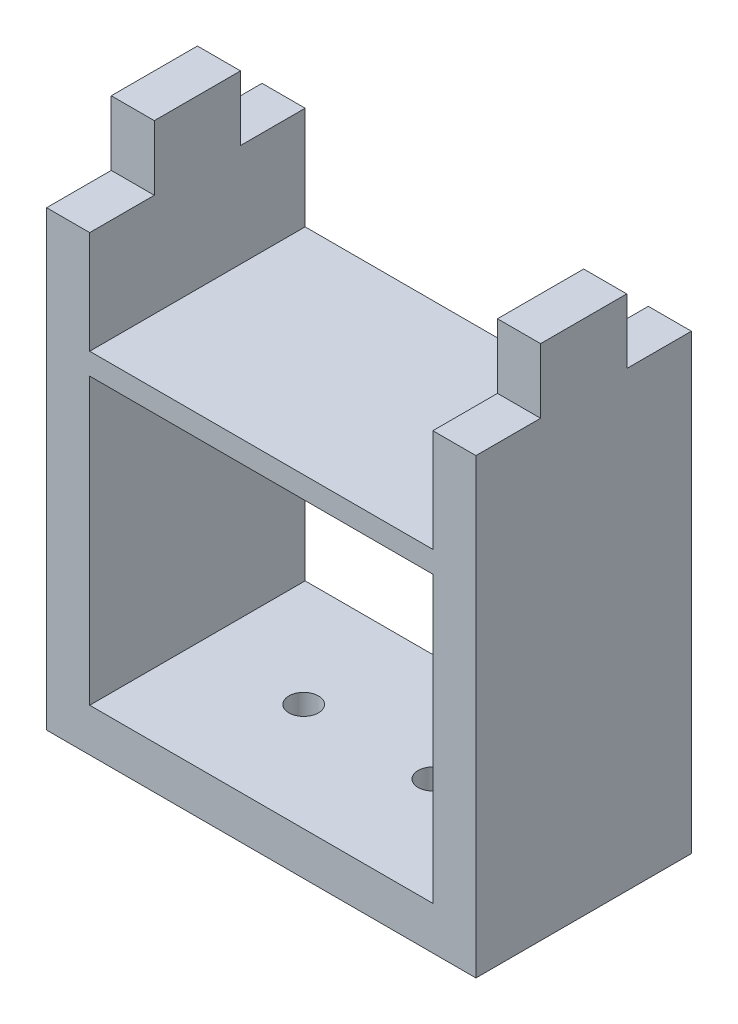
ISO-10303-21;
HEADER;
FILE_DESCRIPTION(('STEP AP214'),'2;1');
FILE_NAME('part.step','',(''),(''),'','','');
FILE_SCHEMA(('AUTOMOTIVE_DESIGN { 1 0 10303 214 1 1 1 1 }'));
ENDSEC;
DATA;
#1=APPLICATION_CONTEXT('core data for automotive mechanical design processes');
#2=APPLICATION_PROTOCOL_DEFINITION('international standard','automotive_design',2000,#1);
#3=PRODUCT_CONTEXT('',#1,'mechanical');
#4=PRODUCT('Part','Part','',(#3));
#5=PRODUCT_RELATED_PRODUCT_CATEGORY('part','',(#4));
#6=PRODUCT_DEFINITION_FORMATION('','',#4);
#7=PRODUCT_DEFINITION_CONTEXT('part definition',#1,'design');
#8=PRODUCT_DEFINITION('design','',#6,#7);
#9=PRODUCT_DEFINITION_SHAPE('','',#8);
#10=(LENGTH_UNIT() NAMED_UNIT(*) SI_UNIT(.MILLI.,.METRE.));
#11=(NAMED_UNIT(*) PLANE_ANGLE_UNIT() SI_UNIT($,.RADIAN.));
#12=(NAMED_UNIT(*) SI_UNIT($,.STERADIAN.) SOLID_ANGLE_UNIT());
#13=UNCERTAINTY_MEASURE_WITH_UNIT(LENGTH_MEASURE(1.E-05),#10,'distance_accuracy_value','');
#14=(GEOMETRIC_REPRESENTATION_CONTEXT(3) GLOBAL_UNCERTAINTY_ASSIGNED_CONTEXT((#13)) GLOBAL_UNIT_ASSIGNED_CONTEXT((#10,
#11,#12)) REPRESENTATION_CONTEXT('',''));
#15=CARTESIAN_POINT('',(0.,0.,0.));
#16=DIRECTION('',(0.,0.,1.));
#17=DIRECTION('',(1.,0.,0.));
#18=AXIS2_PLACEMENT_3D('',#15,#16,#17);
#19=CARTESIAN_POINT('',(71.8800104345077,105.,35.));
#20=DIRECTION('',(0.,-1.,0.));
#21=DIRECTION('',(1.,0.,0.));
#22=AXIS2_PLACEMENT_3D('',#19,#20,#21);
#23=PLANE('',#22);
#24=DIRECTION('',(0.,0.,-1.));
#25=VECTOR('',#24,1.);
#26=CARTESIAN_POINT('',(-30.5064857593433,105.,50.));
#27=LINE('',#26,#25);
#28=CARTESIAN_POINT('',(-30.5064857593433,105.,50.));
#29=VERTEX_POINT('',#28);
#30=CARTESIAN_POINT('',(-30.5064857593433,105.,35.));
#31=VERTEX_POINT('',#30);
#32=EDGE_CURVE('E351',#29,#31,#27,.T.);
#33=ORIENTED_EDGE('',*,*,#32,.T.);
#34=DIRECTION('',(-1.,0.,0.));
#35=VECTOR('',#34,1.);
#36=CARTESIAN_POINT('',(71.8800104345077,105.,35.));
#37=LINE('',#36,#35);
#38=CARTESIAN_POINT('',(-40.5064857593433,105.,35.));
#39=VERTEX_POINT('',#38);
#40=EDGE_CURVE('E11',#31,#39,#37,.T.);
#41=ORIENTED_EDGE('',*,*,#40,.T.);
#42=DIRECTION('',(0.,0.,-1.));
#43=VECTOR('',#42,1.);
#44=CARTESIAN_POINT('',(-40.5064857593433,105.,50.));
#45=LINE('',#44,#43);
#46=CARTESIAN_POINT('',(-40.5064857593433,105.,50.));
#47=VERTEX_POINT('',#46);
#48=EDGE_CURVE('E314',#47,#39,#45,.T.);
#49=ORIENTED_EDGE('',*,*,#48,.F.);
#50=DIRECTION('',(1.,0.,0.));
#51=VECTOR('',#50,1.);
#52=CARTESIAN_POINT('',(0.,105.,50.));
#53=LINE('',#52,#51);
#54=EDGE_CURVE('E335',#47,#29,#53,.T.);
#55=ORIENTED_EDGE('',*,*,#54,.T.);
#56=EDGE_LOOP('',(#33,#41,#49,#55));
#57=FACE_BOUND('',#56,.T.);
#58=ADVANCED_FACE('F43',(#57),#23,.F.);
#59=CARTESIAN_POINT('',(71.8800104345077,120.,35.));
#60=DIRECTION('',(0.,0.,-1.));
#61=DIRECTION('',(-1.,0.,0.));
#62=AXIS2_PLACEMENT_3D('',#59,#60,#61);
#63=PLANE('',#62);
#64=DIRECTION('',(0.,1.,0.));
#65=VECTOR('',#64,1.);
#66=CARTESIAN_POINT('',(-30.5064857593433,204.794329494483,35.));
#67=LINE('',#66,#65);
#68=CARTESIAN_POINT('',(-30.5064857593433,120.,35.));
#69=VERTEX_POINT('',#68);
#70=EDGE_CURVE('E354',#31,#69,#67,.T.);
#71=ORIENTED_EDGE('',*,*,#70,.T.);
#72=DIRECTION('',(-1.,0.,0.));
#73=VECTOR('',#72,1.);
#74=CARTESIAN_POINT('',(71.8800104345077,120.,35.));
#75=LINE('',#74,#73);
#76=CARTESIAN_POINT('',(-40.5064857593433,120.,35.));
#77=VERTEX_POINT('',#76);
#78=EDGE_CURVE('E337',#69,#77,#75,.T.);
#79=ORIENTED_EDGE('',*,*,#78,.T.);
#80=DIRECTION('',(0.,1.,0.));
#81=VECTOR('',#80,1.);
#82=CARTESIAN_POINT('',(-40.5064857593433,210.,35.));
#83=LINE('',#82,#81);
#84=EDGE_CURVE('E317',#39,#77,#83,.T.);
#85=ORIENTED_EDGE('',*,*,#84,.F.);
#86=ORIENTED_EDGE('',*,*,#40,.F.);
#87=EDGE_LOOP('',(#71,#79,#85,#86));
#88=FACE_BOUND('',#87,.T.);
#89=ADVANCED_FACE('F426',(#88),#63,.F.);
#90=CARTESIAN_POINT('',(71.8800104345077,120.,15.));
#91=DIRECTION('',(0.,-1.,0.));
#92=DIRECTION('',(1.,0.,0.));
#93=AXIS2_PLACEMENT_3D('',#90,#91,#92);
#94=PLANE('',#93);
#95=DIRECTION('',(0.,0.,-1.));
#96=VECTOR('',#95,1.);
#97=CARTESIAN_POINT('',(-30.5064857593433,120.,50.));
#98=LINE('',#97,#96);
#99=CARTESIAN_POINT('',(-30.5064857593433,120.,15.));
#100=VERTEX_POINT('',#99);
#101=EDGE_CURVE('E362',#69,#100,#98,.T.);
#102=ORIENTED_EDGE('',*,*,#101,.T.);
#103=DIRECTION('',(-1.,0.,0.));
#104=VECTOR('',#103,1.);
#105=CARTESIAN_POINT('',(71.8800104345077,120.,15.));
#106=LINE('',#105,#104);
#107=CARTESIAN_POINT('',(-40.5064857593433,120.,15.));
#108=VERTEX_POINT('',#107);
#109=EDGE_CURVE('E342',#100,#108,#106,.T.);
#110=ORIENTED_EDGE('',*,*,#109,.T.);
#111=DIRECTION('',(0.,0.,-1.));
#112=VECTOR('',#111,1.);
#113=CARTESIAN_POINT('',(-40.5064857593433,120.,50.));
#114=LINE('',#113,#112);
#115=EDGE_CURVE('E320',#77,#108,#114,.T.);
#116=ORIENTED_EDGE('',*,*,#115,.F.);
#117=ORIENTED_EDGE('',*,*,#78,.F.);
#118=EDGE_LOOP('',(#102,#110,#116,#117));
#119=FACE_BOUND('',#118,.T.);
#120=ADVANCED_FACE('F430',(#119),#94,.F.);
#121=CARTESIAN_POINT('',(71.8800104345077,105.,15.));
#122=DIRECTION('',(0.,0.,1.));
#123=DIRECTION('',(1.,0.,0.));
#124=AXIS2_PLACEMENT_3D('',#121,#122,#123);
#125=PLANE('',#124);
#126=DIRECTION('',(0.,-1.,0.));
#127=VECTOR('',#126,1.);
#128=CARTESIAN_POINT('',(-30.5064857593433,204.794329494483,15.));
#129=LINE('',#128,#127);
#130=CARTESIAN_POINT('',(-30.5064857593433,105.,15.));
#131=VERTEX_POINT('',#130);
#132=EDGE_CURVE('E368',#100,#131,#129,.T.);
#133=ORIENTED_EDGE('',*,*,#132,.T.);
#134=DIRECTION('',(-1.,0.,0.));
#135=VECTOR('',#134,1.);
#136=CARTESIAN_POINT('',(71.8800104345077,105.,15.));
#137=LINE('',#136,#135);
#138=CARTESIAN_POINT('',(-40.5064857593433,105.,15.));
#139=VERTEX_POINT('',#138);
#140=EDGE_CURVE('E347',#131,#139,#137,.T.);
#141=ORIENTED_EDGE('',*,*,#140,.T.);
#142=DIRECTION('',(0.,-1.,0.));
#143=VECTOR('',#142,1.);
#144=CARTESIAN_POINT('',(-40.5064857593433,210.,15.));
#145=LINE('',#144,#143);
#146=EDGE_CURVE('E323',#108,#139,#145,.T.);
#147=ORIENTED_EDGE('',*,*,#146,.F.);
#148=ORIENTED_EDGE('',*,*,#109,.F.);
#149=EDGE_LOOP('',(#133,#141,#147,#148));
#150=FACE_BOUND('',#149,.T.);
#151=ADVANCED_FACE('F639',(#150),#125,.F.);
#152=CARTESIAN_POINT('',(71.8800104345077,105.,0.));
#153=DIRECTION('',(0.,-1.,0.));
#154=DIRECTION('',(1.,0.,0.));
#155=AXIS2_PLACEMENT_3D('',#152,#153,#154);
#156=PLANE('',#155);
#157=DIRECTION('',(0.,0.,-1.));
#158=VECTOR('',#157,1.);
#159=CARTESIAN_POINT('',(-30.5064857593433,105.,50.));
#160=LINE('',#159,#158);
#161=CARTESIAN_POINT('',(-30.5064857593433,105.,0.));
#162=VERTEX_POINT('',#161);
#163=EDGE_CURVE('E358',#131,#162,#160,.T.);
#164=ORIENTED_EDGE('',*,*,#163,.T.);
#165=DIRECTION('',(1.,0.,0.));
#166=VECTOR('',#165,1.);
#167=CARTESIAN_POINT('',(0.,105.,0.));
#168=LINE('',#167,#166);
#169=CARTESIAN_POINT('',(-40.5064857593433,105.,0.));
#170=VERTEX_POINT('',#169);
#171=EDGE_CURVE('E332',#170,#162,#168,.T.);
#172=ORIENTED_EDGE('',*,*,#171,.F.);
#173=DIRECTION('',(0.,0.,-1.));
#174=VECTOR('',#173,1.);
#175=CARTESIAN_POINT('',(-40.5064857593433,105.,50.));
#176=LINE('',#175,#174);
#177=EDGE_CURVE('E326',#139,#170,#176,.T.);
#178=ORIENTED_EDGE('',*,*,#177,.F.);
#179=ORIENTED_EDGE('',*,*,#140,.F.);
#180=EDGE_LOOP('',(#164,#172,#178,#179));
#181=FACE_BOUND('',#180,.T.);
#182=ADVANCED_FACE('F382',(#181),#156,.F.);
#183=DIRECTION('',(0.,0.,1.));
#184=VECTOR('',#183,1.);
#185=CARTESIAN_POINT('',(49.130974017595,105.,50.));
#186=LINE('',#185,#184);
#187=CARTESIAN_POINT('',(49.130974017595,105.,0.));
#188=VERTEX_POINT('',#187);
#189=CARTESIAN_POINT('',(49.130974017595,105.,15.));
#190=VERTEX_POINT('',#189);
#191=EDGE_CURVE('E47',#188,#190,#186,.T.);
#192=ORIENTED_EDGE('',*,*,#191,.T.);
#193=CARTESIAN_POINT('',(59.130974017595,105.,15.));
#194=VERTEX_POINT('',#193);
#195=EDGE_CURVE('E334',#194,#190,#137,.T.);
#196=ORIENTED_EDGE('',*,*,#195,.F.);
#197=DIRECTION('',(0.,0.,1.));
#198=VECTOR('',#197,1.);
#199=CARTESIAN_POINT('',(59.130974017595,105.,50.));
#200=LINE('',#199,#198);
#201=CARTESIAN_POINT('',(59.130974017595,105.,0.));
#202=VERTEX_POINT('',#201);
#203=EDGE_CURVE('E311',#202,#194,#200,.T.);
#204=ORIENTED_EDGE('',*,*,#203,.F.);
#205=EDGE_CURVE('E329',#188,#202,#168,.T.);
#206=ORIENTED_EDGE('',*,*,#205,.F.);
#207=EDGE_LOOP('',(#192,#196,#204,#206));
#208=FACE_BOUND('',#207,.T.);
#209=ADVANCED_FACE('F45',(#208),#156,.F.);
#210=DIRECTION('',(0.,1.,0.));
#211=VECTOR('',#210,1.);
#212=CARTESIAN_POINT('',(49.130974017595,10.,15.));
#213=LINE('',#212,#211);
#214=CARTESIAN_POINT('',(49.130974017595,120.,15.));
#215=VERTEX_POINT('',#214);
#216=EDGE_CURVE('E371',#190,#215,#213,.T.);
#217=ORIENTED_EDGE('',*,*,#216,.T.);
#218=CARTESIAN_POINT('',(59.130974017595,120.,15.));
#219=VERTEX_POINT('',#218);
#220=EDGE_CURVE('E346',#219,#215,#106,.T.);
#221=ORIENTED_EDGE('',*,*,#220,.F.);
#222=DIRECTION('',(0.,1.,0.));
#223=VECTOR('',#222,1.);
#224=CARTESIAN_POINT('',(59.130974017595,0.,15.));
#225=LINE('',#224,#223);
#226=EDGE_CURVE('E308',#194,#219,#225,.T.);
#227=ORIENTED_EDGE('',*,*,#226,.F.);
#228=ORIENTED_EDGE('',*,*,#195,.T.);
#229=EDGE_LOOP('',(#217,#221,#227,#228));
#230=FACE_BOUND('',#229,.T.);
#231=ADVANCED_FACE('F401',(#230),#125,.F.);
#232=DIRECTION('',(0.,0.,1.));
#233=VECTOR('',#232,1.);
#234=CARTESIAN_POINT('',(49.130974017595,120.,50.));
#235=LINE('',#234,#233);
#236=CARTESIAN_POINT('',(49.130974017595,120.,35.));
#237=VERTEX_POINT('',#236);
#238=EDGE_CURVE('E365',#215,#237,#235,.T.);
#239=ORIENTED_EDGE('',*,*,#238,.T.);
#240=CARTESIAN_POINT('',(59.130974017595,120.,35.));
#241=VERTEX_POINT('',#240);
#242=EDGE_CURVE('E341',#241,#237,#75,.T.);
#243=ORIENTED_EDGE('',*,*,#242,.F.);
#244=DIRECTION('',(0.,0.,1.));
#245=VECTOR('',#244,1.);
#246=CARTESIAN_POINT('',(59.130974017595,120.,50.));
#247=LINE('',#246,#245);
#248=EDGE_CURVE('E66',#219,#241,#247,.T.);
#249=ORIENTED_EDGE('',*,*,#248,.F.);
#250=ORIENTED_EDGE('',*,*,#220,.T.);
#251=EDGE_LOOP('',(#239,#243,#249,#250));
#252=FACE_BOUND('',#251,.T.);
#253=ADVANCED_FACE('F409',(#252),#94,.F.);
#254=DIRECTION('',(0.,-1.,0.));
#255=VECTOR('',#254,1.);
#256=CARTESIAN_POINT('',(49.130974017595,10.,35.));
#257=LINE('',#256,#255);
#258=CARTESIAN_POINT('',(49.130974017595,105.,35.));
#259=VERTEX_POINT('',#258);
#260=EDGE_CURVE('E359',#237,#259,#257,.T.);
#261=ORIENTED_EDGE('',*,*,#260,.T.);
#262=CARTESIAN_POINT('',(59.130974017595,105.,35.));
#263=VERTEX_POINT('',#262);
#264=EDGE_CURVE('E53',#263,#259,#37,.T.);
#265=ORIENTED_EDGE('',*,*,#264,.F.);
#266=DIRECTION('',(0.,-1.,0.));
#267=VECTOR('',#266,1.);
#268=CARTESIAN_POINT('',(59.130974017595,0.,35.));
#269=LINE('',#268,#267);
#270=EDGE_CURVE('E61',#241,#263,#269,.T.);
#271=ORIENTED_EDGE('',*,*,#270,.F.);
#272=ORIENTED_EDGE('',*,*,#242,.T.);
#273=EDGE_LOOP('',(#261,#265,#271,#272));
#274=FACE_BOUND('',#273,.T.);
#275=ADVANCED_FACE('F411',(#274),#63,.F.);
#276=DIRECTION('',(0.,0.,1.));
#277=VECTOR('',#276,1.);
#278=CARTESIAN_POINT('',(49.130974017595,105.,50.));
#279=LINE('',#278,#277);
#280=CARTESIAN_POINT('',(49.130974017595,105.,50.));
#281=VERTEX_POINT('',#280);
#282=EDGE_CURVE('E355',#259,#281,#279,.T.);
#283=ORIENTED_EDGE('',*,*,#282,.T.);
#284=CARTESIAN_POINT('',(59.130974017595,105.,50.));
#285=VERTEX_POINT('',#284);
#286=EDGE_CURVE('E191',#281,#285,#53,.T.);
#287=ORIENTED_EDGE('',*,*,#286,.T.);
#288=DIRECTION('',(0.,0.,1.));
#289=VECTOR('',#288,1.);
#290=CARTESIAN_POINT('',(59.130974017595,105.,50.));
#291=LINE('',#290,#289);
#292=EDGE_CURVE('E301',#263,#285,#291,.T.);
#293=ORIENTED_EDGE('',*,*,#292,.F.);
#294=ORIENTED_EDGE('',*,*,#264,.T.);
#295=EDGE_LOOP('',(#283,#287,#293,#294));
#296=FACE_BOUND('',#295,.T.);
#297=ADVANCED_FACE('F445',(#296),#23,.F.);
#298=CARTESIAN_POINT('',(24.130974017595,0.,25.));
#299=DIRECTION('',(0.,1.,0.));
#300=DIRECTION('',(0.,0.,1.));
#301=AXIS2_PLACEMENT_3D('',#298,#299,#300);
#302=CYLINDRICAL_SURFACE('',#301,3.425);
#303=CARTESIAN_POINT('',(24.130974017595,0.,25.));
#304=DIRECTION('',(0.,1.,0.));
#305=DIRECTION('',(0.,0.,1.));
#306=AXIS2_PLACEMENT_3D('',#303,#304,#305);
#307=CIRCLE('',#306,3.425);
#308=CARTESIAN_POINT('',(24.130974017595,0.,28.425));
#309=VERTEX_POINT('',#308);
#310=EDGE_CURVE('E222',#309,#309,#307,.T.);
#311=ORIENTED_EDGE('',*,*,#310,.F.);
#312=EDGE_LOOP('',(#311));
#313=FACE_BOUND('',#312,.T.);
#314=CARTESIAN_POINT('',(24.130974017595,10.,25.));
#315=DIRECTION('',(0.,1.,0.));
#316=DIRECTION('',(0.,0.,1.));
#317=AXIS2_PLACEMENT_3D('',#314,#315,#316);
#318=CIRCLE('',#317,3.425);
#319=CARTESIAN_POINT('',(24.130974017595,10.,28.425));
#320=VERTEX_POINT('',#319);
#321=EDGE_CURVE('E240',#320,#320,#318,.T.);
#322=ORIENTED_EDGE('',*,*,#321,.T.);
#323=EDGE_LOOP('',(#322));
#324=FACE_BOUND('',#323,.T.);
#325=ADVANCED_FACE('F447',(#313,#324),#302,.F.);
#326=CARTESIAN_POINT('',(-5.85128713251137,0.,25.));
#327=DIRECTION('',(0.,1.,0.));
#328=DIRECTION('',(0.,0.,1.));
#329=AXIS2_PLACEMENT_3D('',#326,#327,#328);
#330=CYLINDRICAL_SURFACE('',#329,3.425);
#331=CARTESIAN_POINT('',(-5.85128713251137,0.,25.));
#332=DIRECTION('',(0.,1.,0.));
#333=DIRECTION('',(0.,0.,1.));
#334=AXIS2_PLACEMENT_3D('',#331,#332,#333);
#335=CIRCLE('',#334,3.425);
#336=CARTESIAN_POINT('',(-5.85128713251137,0.,28.425));
#337=VERTEX_POINT('',#336);
#338=EDGE_CURVE('E232',#337,#337,#335,.T.);
#339=ORIENTED_EDGE('',*,*,#338,.F.);
#340=EDGE_LOOP('',(#339));
#341=FACE_BOUND('',#340,.T.);
#342=CARTESIAN_POINT('',(-5.85128713251137,10.,25.));
#343=DIRECTION('',(0.,1.,0.));
#344=DIRECTION('',(0.,0.,1.));
#345=AXIS2_PLACEMENT_3D('',#342,#343,#344);
#346=CIRCLE('',#345,3.425);
#347=CARTESIAN_POINT('',(-5.85128713251137,10.,28.425));
#348=VERTEX_POINT('',#347);
#349=EDGE_CURVE('E236',#348,#348,#346,.T.);
#350=ORIENTED_EDGE('',*,*,#349,.T.);
#351=EDGE_LOOP('',(#350));
#352=FACE_BOUND('',#351,.T.);
#353=ADVANCED_FACE('F453',(#341,#352),#330,.F.);
#354=CARTESIAN_POINT('',(-30.5064857593433,10.,50.));
#355=DIRECTION('',(0.,1.,0.));
#356=DIRECTION('',(0.,0.,1.));
#357=AXIS2_PLACEMENT_3D('',#354,#355,#356);
#358=PLANE('',#357);
#359=ORIENTED_EDGE('',*,*,#349,.F.);
#360=EDGE_LOOP('',(#359));
#361=FACE_BOUND('',#360,.T.);
#362=ORIENTED_EDGE('',*,*,#321,.F.);
#363=EDGE_LOOP('',(#362));
#364=FACE_BOUND('',#363,.T.);
#365=DIRECTION('',(1.,0.,0.));
#366=VECTOR('',#365,1.);
#367=CARTESIAN_POINT('',(-30.5064857593433,10.,0.));
#368=LINE('',#367,#366);
#369=CARTESIAN_POINT('',(-30.5064857593433,10.,0.));
#370=VERTEX_POINT('',#369);
#371=CARTESIAN_POINT('',(49.130974017595,10.,0.));
#372=VERTEX_POINT('',#371);
#373=EDGE_CURVE('E197',#370,#372,#368,.T.);
#374=ORIENTED_EDGE('',*,*,#373,.F.);
#375=DIRECTION('',(0.,0.,-1.));
#376=VECTOR('',#375,1.);
#377=CARTESIAN_POINT('',(-30.5064857593433,10.,50.));
#378=LINE('',#377,#376);
#379=CARTESIAN_POINT('',(-30.5064857593433,10.,50.));
#380=VERTEX_POINT('',#379);
#381=EDGE_CURVE('E270',#380,#370,#378,.T.);
#382=ORIENTED_EDGE('',*,*,#381,.F.);
#383=DIRECTION('',(1.,0.,0.));
#384=VECTOR('',#383,1.);
#385=CARTESIAN_POINT('',(-30.5064857593433,10.,50.));
#386=LINE('',#385,#384);
#387=CARTESIAN_POINT('',(49.130974017595,10.,50.));
#388=VERTEX_POINT('',#387);
#389=EDGE_CURVE('E252',#380,#388,#386,.T.);
#390=ORIENTED_EDGE('',*,*,#389,.T.);
#391=DIRECTION('',(0.,0.,-1.));
#392=VECTOR('',#391,1.);
#393=CARTESIAN_POINT('',(49.130974017595,10.,50.));
#394=LINE('',#393,#392);
#395=EDGE_CURVE('E255',#388,#372,#394,.T.);
#396=ORIENTED_EDGE('',*,*,#395,.T.);
#397=EDGE_LOOP('',(#374,#382,#390,#396));
#398=FACE_BOUND('',#397,.T.);
#399=ADVANCED_FACE('F480',(#361,#364,#398),#358,.T.);
#400=CARTESIAN_POINT('',(-30.5064857593433,204.794329494483,50.));
#401=DIRECTION('',(1.,0.,0.));
#402=DIRECTION('',(0.,0.,-1.));
#403=AXIS2_PLACEMENT_3D('',#400,#401,#402);
#404=PLANE('',#403);
#405=DIRECTION('',(0.,0.,1.));
#406=VECTOR('',#405,1.);
#407=CARTESIAN_POINT('',(-30.5064857593433,76.1512971011657,0.));
#408=LINE('',#407,#406);
#409=CARTESIAN_POINT('',(-30.5064857593433,76.1512971011657,0.));
#410=VERTEX_POINT('',#409);
#411=CARTESIAN_POINT('',(-30.5064857593433,76.1512971011657,50.));
#412=VERTEX_POINT('',#411);
#413=EDGE_CURVE('E230',#410,#412,#408,.T.);
#414=ORIENTED_EDGE('',*,*,#413,.T.);
#415=DIRECTION('',(0.,-1.,0.));
#416=VECTOR('',#415,1.);
#417=CARTESIAN_POINT('',(-30.5064857593433,204.794329494483,50.));
#418=LINE('',#417,#416);
#419=EDGE_CURVE('E248',#412,#380,#418,.T.);
#420=ORIENTED_EDGE('',*,*,#419,.T.);
#421=ORIENTED_EDGE('',*,*,#381,.T.);
#422=DIRECTION('',(0.,-1.,0.));
#423=VECTOR('',#422,1.);
#424=CARTESIAN_POINT('',(-30.5064857593433,204.794329494483,0.));
#425=LINE('',#424,#423);
#426=EDGE_CURVE('E260',#410,#370,#425,.T.);
#427=ORIENTED_EDGE('',*,*,#426,.F.);
#428=EDGE_LOOP('',(#414,#420,#421,#427));
#429=FACE_BOUND('',#428,.T.);
#430=ADVANCED_FACE('F477',(#429),#404,.T.);
#431=CARTESIAN_POINT('',(49.130974017595,76.1512971011657,0.));
#432=DIRECTION('',(0.,-1.,0.));
#433=DIRECTION('',(1.,0.,0.));
#434=AXIS2_PLACEMENT_3D('',#431,#432,#433);
#435=PLANE('',#434);
#436=DIRECTION('',(1.,0.,0.));
#437=VECTOR('',#436,1.);
#438=CARTESIAN_POINT('',(49.130974017595,76.1512971011657,50.));
#439=LINE('',#438,#437);
#440=CARTESIAN_POINT('',(49.130974017595,76.1512971011657,50.));
#441=VERTEX_POINT('',#440);
#442=EDGE_CURVE('E216',#412,#441,#439,.T.);
#443=ORIENTED_EDGE('',*,*,#442,.F.);
#444=ORIENTED_EDGE('',*,*,#413,.F.);
#445=DIRECTION('',(1.,0.,0.));
#446=VECTOR('',#445,1.);
#447=CARTESIAN_POINT('',(49.130974017595,76.1512971011657,0.));
#448=LINE('',#447,#446);
#449=CARTESIAN_POINT('',(49.130974017595,76.1512971011657,0.));
#450=VERTEX_POINT('',#449);
#451=EDGE_CURVE('E217',#410,#450,#448,.T.);
#452=ORIENTED_EDGE('',*,*,#451,.T.);
#453=DIRECTION('',(0.,0.,1.));
#454=VECTOR('',#453,1.);
#455=CARTESIAN_POINT('',(49.130974017595,76.1512971011657,0.));
#456=LINE('',#455,#454);
#457=EDGE_CURVE('E209',#450,#441,#456,.T.);
#458=ORIENTED_EDGE('',*,*,#457,.T.);
#459=EDGE_LOOP('',(#443,#444,#452,#458));
#460=FACE_BOUND('',#459,.T.);
#461=ADVANCED_FACE('F475',(#460),#435,.T.);
#462=CARTESIAN_POINT('',(49.130974017595,10.,50.));
#463=DIRECTION('',(-1.,0.,0.));
#464=DIRECTION('',(0.,0.,1.));
#465=AXIS2_PLACEMENT_3D('',#462,#463,#464);
#466=PLANE('',#465);
#467=ORIENTED_EDGE('',*,*,#457,.F.);
#468=DIRECTION('',(0.,1.,0.));
#469=VECTOR('',#468,1.);
#470=CARTESIAN_POINT('',(49.130974017595,10.,0.));
#471=LINE('',#470,#469);
#472=EDGE_CURVE('E256',#372,#450,#471,.T.);
#473=ORIENTED_EDGE('',*,*,#472,.F.);
#474=ORIENTED_EDGE('',*,*,#395,.F.);
#475=DIRECTION('',(0.,1.,0.));
#476=VECTOR('',#475,1.);
#477=CARTESIAN_POINT('',(49.130974017595,10.,50.));
#478=LINE('',#477,#476);
#479=EDGE_CURVE('E196',#388,#441,#478,.T.);
#480=ORIENTED_EDGE('',*,*,#479,.T.);
#481=EDGE_LOOP('',(#467,#473,#474,#480));
#482=FACE_BOUND('',#481,.T.);
#483=ADVANCED_FACE('F472',(#482),#466,.T.);
#484=ORIENTED_EDGE('',*,*,#191,.F.);
#485=CARTESIAN_POINT('',(49.130974017595,81.1512971011657,0.));
#486=VERTEX_POINT('',#485);
#487=EDGE_CURVE('E204',#486,#188,#471,.T.);
#488=ORIENTED_EDGE('',*,*,#487,.F.);
#489=DIRECTION('',(0.,0.,1.));
#490=VECTOR('',#489,1.);
#491=CARTESIAN_POINT('',(49.130974017595,81.1512971011657,0.));
#492=LINE('',#491,#490);
#493=CARTESIAN_POINT('',(49.130974017595,81.1512971011657,50.));
#494=VERTEX_POINT('',#493);
#495=EDGE_CURVE('E200',#486,#494,#492,.T.);
#496=ORIENTED_EDGE('',*,*,#495,.T.);
#497=EDGE_CURVE('E182',#494,#281,#478,.T.);
#498=ORIENTED_EDGE('',*,*,#497,.T.);
#499=ORIENTED_EDGE('',*,*,#282,.F.);
#500=ORIENTED_EDGE('',*,*,#260,.F.);
#501=ORIENTED_EDGE('',*,*,#238,.F.);
#502=ORIENTED_EDGE('',*,*,#216,.F.);
#503=EDGE_LOOP('',(#484,#488,#496,#498,#499,#500,#501,#502));
#504=FACE_BOUND('',#503,.T.);
#505=ADVANCED_FACE('F202',(#504),#466,.T.);
#506=CARTESIAN_POINT('',(-30.5064857593433,81.1512971011657,0.));
#507=DIRECTION('',(0.,1.,0.));
#508=DIRECTION('',(-1.,0.,0.));
#509=AXIS2_PLACEMENT_3D('',#506,#507,#508);
#510=PLANE('',#509);
#511=DIRECTION('',(-1.,0.,0.));
#512=VECTOR('',#511,1.);
#513=CARTESIAN_POINT('',(-30.5064857593433,81.1512971011657,50.));
#514=LINE('',#513,#512);
#515=CARTESIAN_POINT('',(-30.5064857593433,81.1512971011657,50.));
#516=VERTEX_POINT('',#515);
#517=EDGE_CURVE('E188',#494,#516,#514,.T.);
#518=ORIENTED_EDGE('',*,*,#517,.F.);
#519=ORIENTED_EDGE('',*,*,#495,.F.);
#520=DIRECTION('',(-1.,0.,0.));
#521=VECTOR('',#520,1.);
#522=CARTESIAN_POINT('',(-30.5064857593433,81.1512971011657,0.));
#523=LINE('',#522,#521);
#524=CARTESIAN_POINT('',(-30.5064857593433,81.1512971011657,0.));
#525=VERTEX_POINT('',#524);
#526=EDGE_CURVE('E225',#486,#525,#523,.T.);
#527=ORIENTED_EDGE('',*,*,#526,.T.);
#528=DIRECTION('',(0.,0.,1.));
#529=VECTOR('',#528,1.);
#530=CARTESIAN_POINT('',(-30.5064857593433,81.1512971011657,0.));
#531=LINE('',#530,#529);
#532=EDGE_CURVE('E210',#525,#516,#531,.T.);
#533=ORIENTED_EDGE('',*,*,#532,.T.);
#534=EDGE_LOOP('',(#518,#519,#527,#533));
#535=FACE_BOUND('',#534,.T.);
#536=ADVANCED_FACE('F213',(#535),#510,.T.);
#537=ORIENTED_EDGE('',*,*,#163,.F.);
#538=ORIENTED_EDGE('',*,*,#132,.F.);
#539=ORIENTED_EDGE('',*,*,#101,.F.);
#540=ORIENTED_EDGE('',*,*,#70,.F.);
#541=ORIENTED_EDGE('',*,*,#32,.F.);
#542=EDGE_CURVE('E249',#29,#516,#418,.T.);
#543=ORIENTED_EDGE('',*,*,#542,.T.);
#544=ORIENTED_EDGE('',*,*,#532,.F.);
#545=EDGE_CURVE('E261',#162,#525,#425,.T.);
#546=ORIENTED_EDGE('',*,*,#545,.F.);
#547=EDGE_LOOP('',(#537,#538,#539,#540,#541,#543,#544,#546));
#548=FACE_BOUND('',#547,.T.);
#549=ADVANCED_FACE('F387',(#548),#404,.T.);
#550=CARTESIAN_POINT('',(-40.5064857593433,0.,50.));
#551=DIRECTION('',(0.,1.,0.));
#552=DIRECTION('',(-1.,0.,0.));
#553=AXIS2_PLACEMENT_3D('',#550,#551,#552);
#554=PLANE('',#553);
#555=ORIENTED_EDGE('',*,*,#338,.T.);
#556=EDGE_LOOP('',(#555));
#557=FACE_BOUND('',#556,.T.);
#558=ORIENTED_EDGE('',*,*,#310,.T.);
#559=EDGE_LOOP('',(#558));
#560=FACE_BOUND('',#559,.T.);
#561=DIRECTION('',(1.,0.,0.));
#562=VECTOR('',#561,1.);
#563=CARTESIAN_POINT('',(-40.5064857593433,0.,0.));
#564=LINE('',#563,#562);
#565=CARTESIAN_POINT('',(-40.5064857593433,0.,0.));
#566=VERTEX_POINT('',#565);
#567=CARTESIAN_POINT('',(59.130974017595,0.,0.));
#568=VERTEX_POINT('',#567);
#569=EDGE_CURVE('E288',#566,#568,#564,.T.);
#570=ORIENTED_EDGE('',*,*,#569,.T.);
#571=DIRECTION('',(0.,0.,-1.));
#572=VECTOR('',#571,1.);
#573=CARTESIAN_POINT('',(59.130974017595,0.,50.));
#574=LINE('',#573,#572);
#575=CARTESIAN_POINT('',(59.130974017595,0.,50.));
#576=VERTEX_POINT('',#575);
#577=EDGE_CURVE('E285',#576,#568,#574,.T.);
#578=ORIENTED_EDGE('',*,*,#577,.F.);
#579=DIRECTION('',(1.,0.,0.));
#580=VECTOR('',#579,1.);
#581=CARTESIAN_POINT('',(-40.5064857593433,0.,50.));
#582=LINE('',#581,#580);
#583=CARTESIAN_POINT('',(-40.5064857593433,0.,50.));
#584=VERTEX_POINT('',#583);
#585=EDGE_CURVE('E278',#584,#576,#582,.T.);
#586=ORIENTED_EDGE('',*,*,#585,.F.);
#587=DIRECTION('',(0.,0.,-1.));
#588=VECTOR('',#587,1.);
#589=CARTESIAN_POINT('',(-40.5064857593433,0.,50.));
#590=LINE('',#589,#588);
#591=EDGE_CURVE('E297',#584,#566,#590,.T.);
#592=ORIENTED_EDGE('',*,*,#591,.T.);
#593=EDGE_LOOP('',(#570,#578,#586,#592));
#594=FACE_BOUND('',#593,.T.);
#595=ADVANCED_FACE('F440',(#557,#560,#594),#554,.F.);
#596=CARTESIAN_POINT('',(0.,0.,50.));
#597=DIRECTION('',(0.,0.,1.));
#598=DIRECTION('',(1.,0.,0.));
#599=AXIS2_PLACEMENT_3D('',#596,#597,#598);
#600=PLANE('',#599);
#601=ORIENTED_EDGE('',*,*,#54,.F.);
#602=DIRECTION('',(0.,-1.,0.));
#603=VECTOR('',#602,1.);
#604=CARTESIAN_POINT('',(-40.5064857593433,210.,50.));
#605=LINE('',#604,#603);
#606=EDGE_CURVE('E275',#47,#584,#605,.T.);
#607=ORIENTED_EDGE('',*,*,#606,.T.);
#608=ORIENTED_EDGE('',*,*,#585,.T.);
#609=DIRECTION('',(0.,1.,0.));
#610=VECTOR('',#609,1.);
#611=CARTESIAN_POINT('',(59.130974017595,0.,50.));
#612=LINE('',#611,#610);
#613=EDGE_CURVE('E282',#576,#285,#612,.T.);
#614=ORIENTED_EDGE('',*,*,#613,.T.);
#615=ORIENTED_EDGE('',*,*,#286,.F.);
#616=ORIENTED_EDGE('',*,*,#497,.F.);
#617=ORIENTED_EDGE('',*,*,#517,.T.);
#618=ORIENTED_EDGE('',*,*,#542,.F.);
#619=EDGE_LOOP('',(#601,#607,#608,#614,#615,#616,#617,#618));
#620=FACE_BOUND('',#619,.T.);
#621=ORIENTED_EDGE('',*,*,#442,.T.);
#622=ORIENTED_EDGE('',*,*,#479,.F.);
#623=ORIENTED_EDGE('',*,*,#389,.F.);
#624=ORIENTED_EDGE('',*,*,#419,.F.);
#625=EDGE_LOOP('',(#621,#622,#623,#624));
#626=FACE_BOUND('',#625,.T.);
#627=ADVANCED_FACE('F184',(#620,#626),#600,.T.);
#628=CARTESIAN_POINT('',(0.,0.,0.));
#629=DIRECTION('',(0.,0.,1.));
#630=DIRECTION('',(1.,0.,0.));
#631=AXIS2_PLACEMENT_3D('',#628,#629,#630);
#632=PLANE('',#631);
#633=DIRECTION('',(0.,-1.,0.));
#634=VECTOR('',#633,1.);
#635=CARTESIAN_POINT('',(-40.5064857593433,210.,0.));
#636=LINE('',#635,#634);
#637=EDGE_CURVE('E274',#170,#566,#636,.T.);
#638=ORIENTED_EDGE('',*,*,#637,.F.);
#639=ORIENTED_EDGE('',*,*,#171,.T.);
#640=ORIENTED_EDGE('',*,*,#545,.T.);
#641=ORIENTED_EDGE('',*,*,#526,.F.);
#642=ORIENTED_EDGE('',*,*,#487,.T.);
#643=ORIENTED_EDGE('',*,*,#205,.T.);
#644=DIRECTION('',(0.,1.,0.));
#645=VECTOR('',#644,1.);
#646=CARTESIAN_POINT('',(59.130974017595,0.,0.));
#647=LINE('',#646,#645);
#648=EDGE_CURVE('E279',#568,#202,#647,.T.);
#649=ORIENTED_EDGE('',*,*,#648,.F.);
#650=ORIENTED_EDGE('',*,*,#569,.F.);
#651=EDGE_LOOP('',(#638,#639,#640,#641,#642,#643,#649,#650));
#652=FACE_BOUND('',#651,.T.);
#653=ORIENTED_EDGE('',*,*,#472,.T.);
#654=ORIENTED_EDGE('',*,*,#451,.F.);
#655=ORIENTED_EDGE('',*,*,#426,.T.);
#656=ORIENTED_EDGE('',*,*,#373,.T.);
#657=EDGE_LOOP('',(#653,#654,#655,#656));
#658=FACE_BOUND('',#657,.T.);
#659=ADVANCED_FACE('F389',(#652,#658),#632,.F.);
#660=CARTESIAN_POINT('',(59.130974017595,0.,50.));
#661=DIRECTION('',(-1.,0.,0.));
#662=DIRECTION('',(0.,-1.,0.));
#663=AXIS2_PLACEMENT_3D('',#660,#661,#662);
#664=PLANE('',#663);
#665=ORIENTED_EDGE('',*,*,#648,.T.);
#666=ORIENTED_EDGE('',*,*,#203,.T.);
#667=ORIENTED_EDGE('',*,*,#226,.T.);
#668=ORIENTED_EDGE('',*,*,#248,.T.);
#669=ORIENTED_EDGE('',*,*,#270,.T.);
#670=ORIENTED_EDGE('',*,*,#292,.T.);
#671=ORIENTED_EDGE('',*,*,#613,.F.);
#672=ORIENTED_EDGE('',*,*,#577,.T.);
#673=EDGE_LOOP('',(#665,#666,#667,#668,#669,#670,#671,#672));
#674=FACE_BOUND('',#673,.T.);
#675=ADVANCED_FACE('F442',(#674),#664,.F.);
#676=CARTESIAN_POINT('',(-40.5064857593433,210.,50.));
#677=DIRECTION('',(1.,0.,0.));
#678=DIRECTION('',(0.,1.,0.));
#679=AXIS2_PLACEMENT_3D('',#676,#677,#678);
#680=PLANE('',#679);
#681=ORIENTED_EDGE('',*,*,#146,.T.);
#682=ORIENTED_EDGE('',*,*,#177,.T.);
#683=ORIENTED_EDGE('',*,*,#637,.T.);
#684=ORIENTED_EDGE('',*,*,#591,.F.);
#685=ORIENTED_EDGE('',*,*,#606,.F.);
#686=ORIENTED_EDGE('',*,*,#48,.T.);
#687=ORIENTED_EDGE('',*,*,#84,.T.);
#688=ORIENTED_EDGE('',*,*,#115,.T.);
#689=EDGE_LOOP('',(#681,#682,#683,#684,#685,#686,#687,#688));
#690=FACE_BOUND('',#689,.T.);
#691=ADVANCED_FACE('F434',(#690),#680,.F.);
#692=CLOSED_SHELL('',(#58,#89,#120,#151,#182,#209,#231,#253,#275,#297,#325,#353,#399,#430,#461,
#483,#505,#536,#549,#595,#627,#659,#675,#691));
#693=MANIFOLD_SOLID_BREP('B2',#692);
#694=ADVANCED_BREP_SHAPE_REPRESENTATION('',(#18,#693),#14);
#695=SHAPE_DEFINITION_REPRESENTATION(#9,#694);
ENDSEC;
END-ISO-10303-21;
